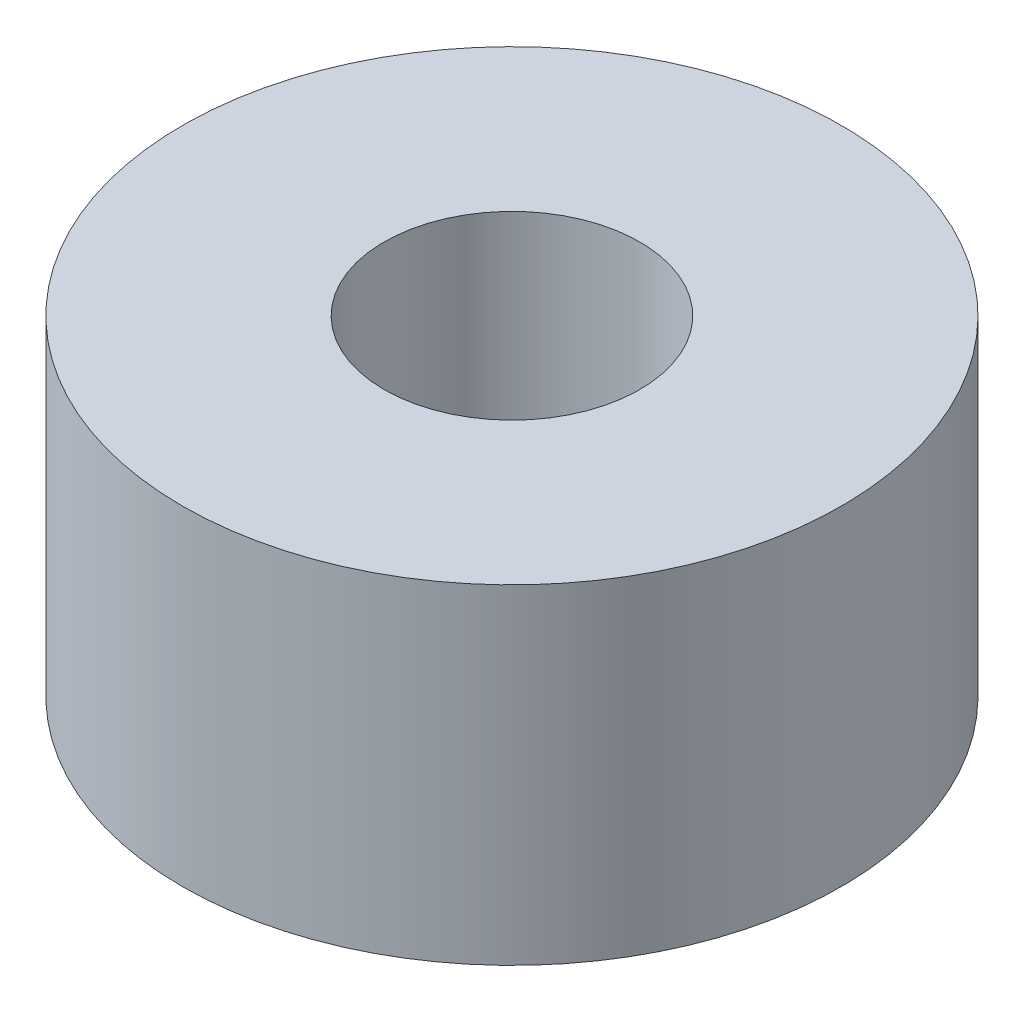
ISO-10303-21;
HEADER;
FILE_DESCRIPTION(('STEP AP214'),'2;1');
FILE_NAME('part.step','',(''),(''),'','','');
FILE_SCHEMA(('AUTOMOTIVE_DESIGN { 1 0 10303 214 1 1 1 1 }'));
ENDSEC;
DATA;
#1=APPLICATION_CONTEXT('core data for automotive mechanical design processes');
#2=APPLICATION_PROTOCOL_DEFINITION('international standard','automotive_design',2000,#1);
#3=PRODUCT_CONTEXT('',#1,'mechanical');
#4=PRODUCT('Part','Part','',(#3));
#5=PRODUCT_RELATED_PRODUCT_CATEGORY('part','',(#4));
#6=PRODUCT_DEFINITION_FORMATION('','',#4);
#7=PRODUCT_DEFINITION_CONTEXT('part definition',#1,'design');
#8=PRODUCT_DEFINITION('design','',#6,#7);
#9=PRODUCT_DEFINITION_SHAPE('','',#8);
#10=(LENGTH_UNIT() NAMED_UNIT(*) SI_UNIT(.MILLI.,.METRE.));
#11=(NAMED_UNIT(*) PLANE_ANGLE_UNIT() SI_UNIT($,.RADIAN.));
#12=(NAMED_UNIT(*) SI_UNIT($,.STERADIAN.) SOLID_ANGLE_UNIT());
#13=UNCERTAINTY_MEASURE_WITH_UNIT(LENGTH_MEASURE(1.E-05),#10,'distance_accuracy_value','');
#14=(GEOMETRIC_REPRESENTATION_CONTEXT(3) GLOBAL_UNCERTAINTY_ASSIGNED_CONTEXT((#13)) GLOBAL_UNIT_ASSIGNED_CONTEXT((#10,
#11,#12)) REPRESENTATION_CONTEXT('',''));
#15=CARTESIAN_POINT('',(0.,0.,0.));
#16=DIRECTION('',(0.,0.,1.));
#17=DIRECTION('',(1.,0.,0.));
#18=AXIS2_PLACEMENT_3D('',#15,#16,#17);
#19=CARTESIAN_POINT('',(0.,3.175,0.));
#20=DIRECTION('',(0.,-1.,0.));
#21=DIRECTION('',(0.,0.,1.));
#22=AXIS2_PLACEMENT_3D('',#19,#20,#21);
#23=CYLINDRICAL_SURFACE('',#22,2.4638);
#24=CARTESIAN_POINT('',(0.,-3.175,0.));
#25=DIRECTION('',(0.,1.,0.));
#26=DIRECTION('',(0.,0.,1.));
#27=AXIS2_PLACEMENT_3D('',#24,#25,#26);
#28=CIRCLE('',#27,2.4638);
#29=CARTESIAN_POINT('',(0.,-3.175,2.4638));
#30=VERTEX_POINT('',#29);
#31=EDGE_CURVE('E44',#30,#30,#28,.T.);
#32=ORIENTED_EDGE('',*,*,#31,.F.);
#33=EDGE_LOOP('',(#32));
#34=FACE_BOUND('',#33,.T.);
#35=CARTESIAN_POINT('',(0.,3.175,0.));
#36=DIRECTION('',(0.,1.,0.));
#37=DIRECTION('',(0.,0.,1.));
#38=AXIS2_PLACEMENT_3D('',#35,#36,#37);
#39=CIRCLE('',#38,2.4638);
#40=CARTESIAN_POINT('',(0.,3.175,2.4638));
#41=VERTEX_POINT('',#40);
#42=EDGE_CURVE('E35',#41,#41,#39,.T.);
#43=ORIENTED_EDGE('',*,*,#42,.T.);
#44=EDGE_LOOP('',(#43));
#45=FACE_BOUND('',#44,.T.);
#46=ADVANCED_FACE('F32',(#34,#45),#23,.F.);
#47=CARTESIAN_POINT('',(0.,3.175,0.));
#48=DIRECTION('',(0.,1.,0.));
#49=DIRECTION('',(0.,0.,-1.));
#50=AXIS2_PLACEMENT_3D('',#47,#48,#49);
#51=PLANE('',#50);
#52=ORIENTED_EDGE('',*,*,#42,.F.);
#53=EDGE_LOOP('',(#52));
#54=FACE_BOUND('',#53,.T.);
#55=CARTESIAN_POINT('',(0.,3.175,0.));
#56=DIRECTION('',(0.,1.,0.));
#57=DIRECTION('',(0.,0.,1.));
#58=AXIS2_PLACEMENT_3D('',#55,#56,#57);
#59=CIRCLE('',#58,6.35);
#60=CARTESIAN_POINT('',(0.,3.175,6.35));
#61=VERTEX_POINT('',#60);
#62=EDGE_CURVE('E39',#61,#61,#59,.T.);
#63=ORIENTED_EDGE('',*,*,#62,.T.);
#64=EDGE_LOOP('',(#63));
#65=FACE_BOUND('',#64,.T.);
#66=ADVANCED_FACE('F53',(#54,#65),#51,.T.);
#67=CARTESIAN_POINT('',(0.,-3.175,0.));
#68=DIRECTION('',(0.,1.,0.));
#69=DIRECTION('',(0.,0.,-1.));
#70=AXIS2_PLACEMENT_3D('',#67,#68,#69);
#71=PLANE('',#70);
#72=ORIENTED_EDGE('',*,*,#31,.T.);
#73=EDGE_LOOP('',(#72));
#74=FACE_BOUND('',#73,.T.);
#75=CARTESIAN_POINT('',(0.,-3.175,0.));
#76=DIRECTION('',(0.,1.,0.));
#77=DIRECTION('',(0.,0.,1.));
#78=AXIS2_PLACEMENT_3D('',#75,#76,#77);
#79=CIRCLE('',#78,6.35);
#80=CARTESIAN_POINT('',(0.,-3.175,6.35));
#81=VERTEX_POINT('',#80);
#82=EDGE_CURVE('E10',#81,#81,#79,.F.);
#83=ORIENTED_EDGE('',*,*,#82,.T.);
#84=EDGE_LOOP('',(#83));
#85=FACE_BOUND('',#84,.T.);
#86=ADVANCED_FACE('F56',(#74,#85),#71,.F.);
#87=CARTESIAN_POINT('',(0.,3.175,0.));
#88=DIRECTION('',(0.,-1.,0.));
#89=DIRECTION('',(0.,0.,1.));
#90=AXIS2_PLACEMENT_3D('',#87,#88,#89);
#91=CYLINDRICAL_SURFACE('',#90,6.35);
#92=ORIENTED_EDGE('',*,*,#62,.F.);
#93=EDGE_LOOP('',(#92));
#94=FACE_BOUND('',#93,.T.);
#95=ORIENTED_EDGE('',*,*,#82,.F.);
#96=EDGE_LOOP('',(#95));
#97=FACE_BOUND('',#96,.T.);
#98=ADVANCED_FACE('F59',(#94,#97),#91,.T.);
#99=CLOSED_SHELL('',(#46,#66,#86,#98));
#100=MANIFOLD_SOLID_BREP('B2',#99);
#101=ADVANCED_BREP_SHAPE_REPRESENTATION('',(#18,#100),#14);
#102=SHAPE_DEFINITION_REPRESENTATION(#9,#101);
ENDSEC;
END-ISO-10303-21;
